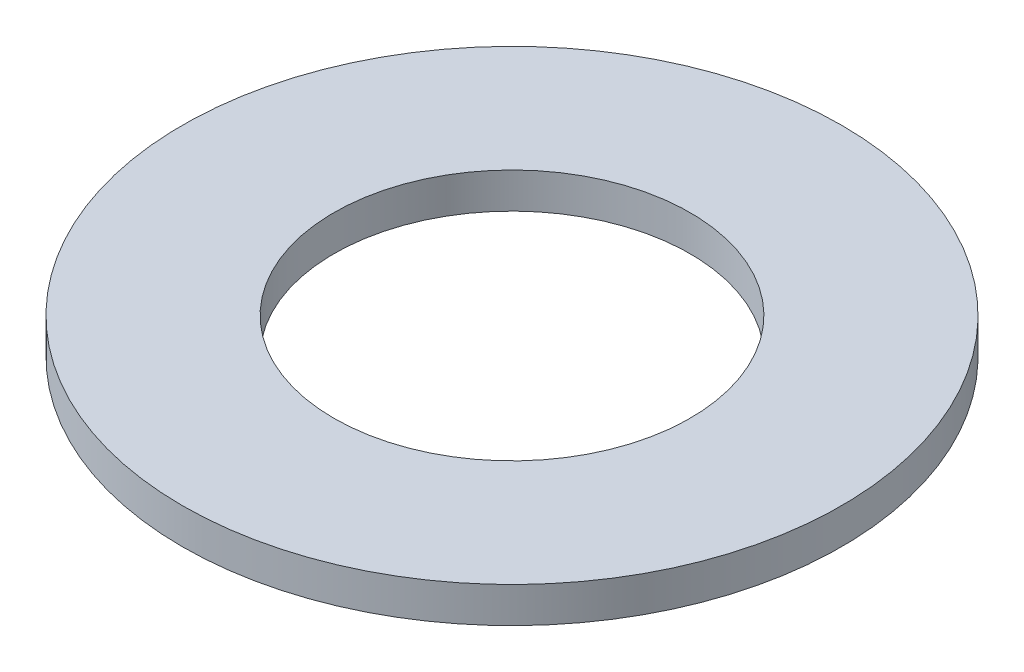
ISO-10303-21;
HEADER;
FILE_DESCRIPTION(('STEP AP214'),'2;1');
FILE_NAME('part.step','',(''),(''),'','','');
FILE_SCHEMA(('AUTOMOTIVE_DESIGN { 1 0 10303 214 1 1 1 1 }'));
ENDSEC;
DATA;
#1=APPLICATION_CONTEXT('core data for automotive mechanical design processes');
#2=APPLICATION_PROTOCOL_DEFINITION('international standard','automotive_design',2000,#1);
#3=PRODUCT_CONTEXT('',#1,'mechanical');
#4=PRODUCT('Part','Part','',(#3));
#5=PRODUCT_RELATED_PRODUCT_CATEGORY('part','',(#4));
#6=PRODUCT_DEFINITION_FORMATION('','',#4);
#7=PRODUCT_DEFINITION_CONTEXT('part definition',#1,'design');
#8=PRODUCT_DEFINITION('design','',#6,#7);
#9=PRODUCT_DEFINITION_SHAPE('','',#8);
#10=(LENGTH_UNIT() NAMED_UNIT(*) SI_UNIT(.MILLI.,.METRE.));
#11=(NAMED_UNIT(*) PLANE_ANGLE_UNIT() SI_UNIT($,.RADIAN.));
#12=(NAMED_UNIT(*) SI_UNIT($,.STERADIAN.) SOLID_ANGLE_UNIT());
#13=UNCERTAINTY_MEASURE_WITH_UNIT(LENGTH_MEASURE(1.E-05),#10,'distance_accuracy_value','');
#14=(GEOMETRIC_REPRESENTATION_CONTEXT(3) GLOBAL_UNCERTAINTY_ASSIGNED_CONTEXT((#13)) GLOBAL_UNIT_ASSIGNED_CONTEXT((#10,
#11,#12)) REPRESENTATION_CONTEXT('',''));
#15=CARTESIAN_POINT('',(0.,0.,0.));
#16=DIRECTION('',(0.,0.,1.));
#17=DIRECTION('',(1.,0.,0.));
#18=AXIS2_PLACEMENT_3D('',#15,#16,#17);
#19=CARTESIAN_POINT('',(0.,10.,0.));
#20=DIRECTION('',(0.,-1.,0.));
#21=DIRECTION('',(0.,0.,-1.));
#22=AXIS2_PLACEMENT_3D('',#19,#20,#21);
#23=CYLINDRICAL_SURFACE('',#22,92.5);
#24=CARTESIAN_POINT('',(0.,10.,0.));
#25=DIRECTION('',(0.,1.,0.));
#26=DIRECTION('',(0.,0.,1.));
#27=AXIS2_PLACEMENT_3D('',#24,#25,#26);
#28=CIRCLE('',#27,92.5);
#29=CARTESIAN_POINT('',(0.,10.,92.5));
#30=VERTEX_POINT('',#29);
#31=EDGE_CURVE('E10',#30,#30,#28,.T.);
#32=ORIENTED_EDGE('',*,*,#31,.F.);
#33=EDGE_LOOP('',(#32));
#34=FACE_BOUND('',#33,.T.);
#35=CARTESIAN_POINT('',(0.,0.,0.));
#36=DIRECTION('',(0.,1.,0.));
#37=DIRECTION('',(0.,0.,1.));
#38=AXIS2_PLACEMENT_3D('',#35,#36,#37);
#39=CIRCLE('',#38,92.5);
#40=CARTESIAN_POINT('',(0.,0.,92.5));
#41=VERTEX_POINT('',#40);
#42=EDGE_CURVE('E37',#41,#41,#39,.T.);
#43=ORIENTED_EDGE('',*,*,#42,.T.);
#44=EDGE_LOOP('',(#43));
#45=FACE_BOUND('',#44,.T.);
#46=ADVANCED_FACE('F40',(#34,#45),#23,.T.);
#47=CARTESIAN_POINT('',(0.,10.,0.));
#48=DIRECTION('',(0.,1.,0.));
#49=DIRECTION('',(0.,0.,1.));
#50=AXIS2_PLACEMENT_3D('',#47,#48,#49);
#51=PLANE('',#50);
#52=CARTESIAN_POINT('',(0.,10.,0.));
#53=DIRECTION('',(0.,1.,0.));
#54=DIRECTION('',(0.,0.,1.));
#55=AXIS2_PLACEMENT_3D('',#52,#53,#54);
#56=CIRCLE('',#55,50.);
#57=CARTESIAN_POINT('',(0.,10.,50.));
#58=VERTEX_POINT('',#57);
#59=EDGE_CURVE('E50',#58,#58,#56,.T.);
#60=ORIENTED_EDGE('',*,*,#59,.F.);
#61=EDGE_LOOP('',(#60));
#62=FACE_BOUND('',#61,.T.);
#63=ORIENTED_EDGE('',*,*,#31,.T.);
#64=EDGE_LOOP('',(#63));
#65=FACE_BOUND('',#64,.T.);
#66=ADVANCED_FACE('F59',(#62,#65),#51,.T.);
#67=CARTESIAN_POINT('',(0.,0.,0.));
#68=DIRECTION('',(0.,1.,0.));
#69=DIRECTION('',(0.,0.,1.));
#70=AXIS2_PLACEMENT_3D('',#67,#68,#69);
#71=PLANE('',#70);
#72=CARTESIAN_POINT('',(0.,0.,0.));
#73=DIRECTION('',(0.,1.,0.));
#74=DIRECTION('',(0.,0.,1.));
#75=AXIS2_PLACEMENT_3D('',#72,#73,#74);
#76=CIRCLE('',#75,50.);
#77=CARTESIAN_POINT('',(0.,0.,50.));
#78=VERTEX_POINT('',#77);
#79=EDGE_CURVE('E47',#78,#78,#76,.T.);
#80=ORIENTED_EDGE('',*,*,#79,.T.);
#81=EDGE_LOOP('',(#80));
#82=FACE_BOUND('',#81,.T.);
#83=ORIENTED_EDGE('',*,*,#42,.F.);
#84=EDGE_LOOP('',(#83));
#85=FACE_BOUND('',#84,.T.);
#86=ADVANCED_FACE('F58',(#82,#85),#71,.F.);
#87=CARTESIAN_POINT('',(0.,10.,0.));
#88=DIRECTION('',(0.,-1.,0.));
#89=DIRECTION('',(0.,0.,-1.));
#90=AXIS2_PLACEMENT_3D('',#87,#88,#89);
#91=CYLINDRICAL_SURFACE('',#90,50.);
#92=ORIENTED_EDGE('',*,*,#59,.T.);
#93=EDGE_LOOP('',(#92));
#94=FACE_BOUND('',#93,.T.);
#95=ORIENTED_EDGE('',*,*,#79,.F.);
#96=EDGE_LOOP('',(#95));
#97=FACE_BOUND('',#96,.T.);
#98=ADVANCED_FACE('F54',(#94,#97),#91,.F.);
#99=CLOSED_SHELL('',(#46,#66,#86,#98));
#100=MANIFOLD_SOLID_BREP('B2',#99);
#101=ADVANCED_BREP_SHAPE_REPRESENTATION('',(#18,#100),#14);
#102=SHAPE_DEFINITION_REPRESENTATION(#9,#101);
ENDSEC;
END-ISO-10303-21;
